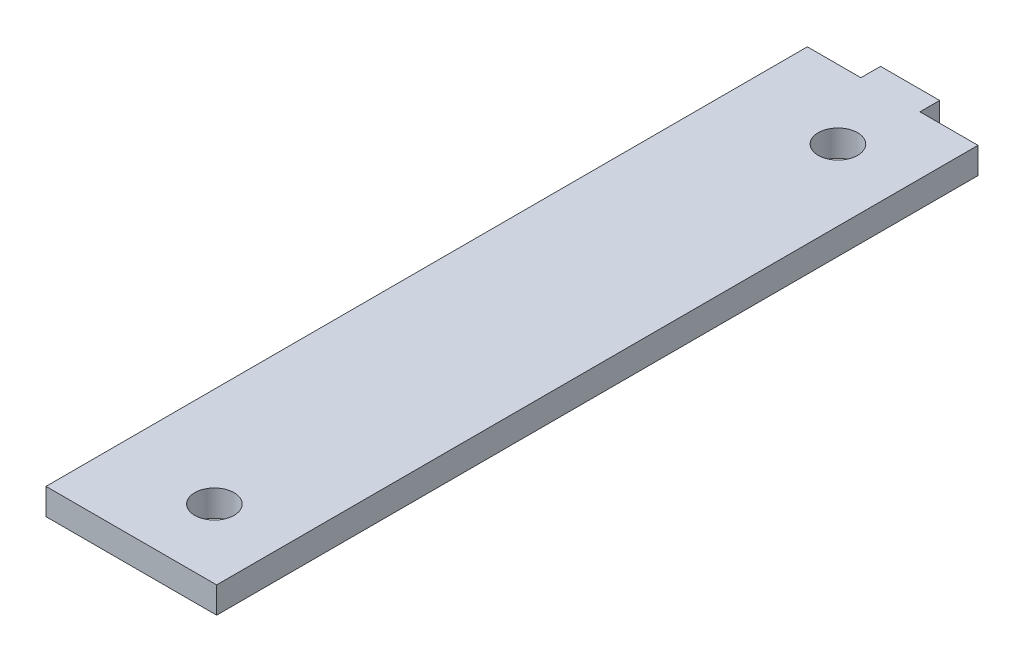
ISO-10303-21;
HEADER;
FILE_DESCRIPTION(('STEP AP214'),'2;1');
FILE_NAME('part.step','',(''),(''),'','','');
FILE_SCHEMA(('AUTOMOTIVE_DESIGN { 1 0 10303 214 1 1 1 1 }'));
ENDSEC;
DATA;
#1=APPLICATION_CONTEXT('core data for automotive mechanical design processes');
#2=APPLICATION_PROTOCOL_DEFINITION('international standard','automotive_design',2000,#1);
#3=PRODUCT_CONTEXT('',#1,'mechanical');
#4=PRODUCT('Part','Part','',(#3));
#5=PRODUCT_RELATED_PRODUCT_CATEGORY('part','',(#4));
#6=PRODUCT_DEFINITION_FORMATION('','',#4);
#7=PRODUCT_DEFINITION_CONTEXT('part definition',#1,'design');
#8=PRODUCT_DEFINITION('design','',#6,#7);
#9=PRODUCT_DEFINITION_SHAPE('','',#8);
#10=(LENGTH_UNIT() NAMED_UNIT(*) SI_UNIT(.MILLI.,.METRE.));
#11=(NAMED_UNIT(*) PLANE_ANGLE_UNIT() SI_UNIT($,.RADIAN.));
#12=(NAMED_UNIT(*) SI_UNIT($,.STERADIAN.) SOLID_ANGLE_UNIT());
#13=UNCERTAINTY_MEASURE_WITH_UNIT(LENGTH_MEASURE(1.E-05),#10,'distance_accuracy_value','');
#14=(GEOMETRIC_REPRESENTATION_CONTEXT(3) GLOBAL_UNCERTAINTY_ASSIGNED_CONTEXT((#13)) GLOBAL_UNIT_ASSIGNED_CONTEXT((#10,
#11,#12)) REPRESENTATION_CONTEXT('',''));
#15=CARTESIAN_POINT('',(0.,0.,0.));
#16=DIRECTION('',(0.,0.,1.));
#17=DIRECTION('',(1.,0.,0.));
#18=AXIS2_PLACEMENT_3D('',#15,#16,#17);
#19=CARTESIAN_POINT('',(70.5,210.,0.));
#20=DIRECTION('',(0.,0.,-1.));
#21=DIRECTION('',(-1.,0.,0.));
#22=AXIS2_PLACEMENT_3D('',#19,#20,#21);
#23=PLANE('',#22);
#24=DIRECTION('',(0.,1.,0.));
#25=VECTOR('',#24,1.);
#26=CARTESIAN_POINT('',(70.5,210.,0.));
#27=LINE('',#26,#25);
#28=CARTESIAN_POINT('',(70.5,206.,0.));
#29=VERTEX_POINT('',#28);
#30=CARTESIAN_POINT('',(70.5,210.,0.));
#31=VERTEX_POINT('',#30);
#32=EDGE_CURVE('E11',#29,#31,#27,.T.);
#33=ORIENTED_EDGE('',*,*,#32,.F.);
#34=DIRECTION('',(1.,0.,0.));
#35=VECTOR('',#34,1.);
#36=CARTESIAN_POINT('',(0.,206.,0.));
#37=LINE('',#36,#35);
#38=CARTESIAN_POINT('',(62.3431457505075,206.,0.));
#39=VERTEX_POINT('',#38);
#40=EDGE_CURVE('E104',#29,#39,#37,.F.);
#41=ORIENTED_EDGE('',*,*,#40,.T.);
#42=DIRECTION('',(0.,1.,0.));
#43=VECTOR('',#42,1.);
#44=CARTESIAN_POINT('',(62.3431457505075,210.,0.));
#45=LINE('',#44,#43);
#46=CARTESIAN_POINT('',(62.3431457505075,210.,0.));
#47=VERTEX_POINT('',#46);
#48=EDGE_CURVE('E47',#39,#47,#45,.T.);
#49=ORIENTED_EDGE('',*,*,#48,.T.);
#50=DIRECTION('',(-1.,0.,0.));
#51=VECTOR('',#50,1.);
#52=CARTESIAN_POINT('',(70.5,210.,0.));
#53=LINE('',#52,#51);
#54=EDGE_CURVE('E146',#31,#47,#53,.T.);
#55=ORIENTED_EDGE('',*,*,#54,.F.);
#56=EDGE_LOOP('',(#33,#41,#49,#55));
#57=FACE_BOUND('',#56,.T.);
#58=ADVANCED_FACE('F37',(#57),#23,.T.);
#59=CARTESIAN_POINT('',(62.3431457505075,210.,0.));
#60=DIRECTION('',(-1.,0.,0.));
#61=DIRECTION('',(0.,0.,1.));
#62=AXIS2_PLACEMENT_3D('',#59,#60,#61);
#63=PLANE('',#62);
#64=ORIENTED_EDGE('',*,*,#48,.F.);
#65=DIRECTION('',(0.,0.,1.));
#66=VECTOR('',#65,1.);
#67=CARTESIAN_POINT('',(62.3431457505075,206.,0.));
#68=LINE('',#67,#66);
#69=CARTESIAN_POINT('',(62.3431457505076,206.,116.));
#70=VERTEX_POINT('',#69);
#71=EDGE_CURVE('E126',#39,#70,#68,.T.);
#72=ORIENTED_EDGE('',*,*,#71,.T.);
#73=DIRECTION('',(0.,1.,0.));
#74=VECTOR('',#73,1.);
#75=CARTESIAN_POINT('',(62.3431457505076,210.,116.));
#76=LINE('',#75,#74);
#77=CARTESIAN_POINT('',(62.3431457505076,210.,116.));
#78=VERTEX_POINT('',#77);
#79=EDGE_CURVE('E139',#70,#78,#76,.T.);
#80=ORIENTED_EDGE('',*,*,#79,.T.);
#81=DIRECTION('',(0.,0.,1.));
#82=VECTOR('',#81,1.);
#83=CARTESIAN_POINT('',(62.3431457505075,210.,0.));
#84=LINE('',#83,#82);
#85=EDGE_CURVE('E155',#47,#78,#84,.T.);
#86=ORIENTED_EDGE('',*,*,#85,.F.);
#87=EDGE_LOOP('',(#64,#72,#80,#86));
#88=FACE_BOUND('',#87,.T.);
#89=ADVANCED_FACE('F158',(#88),#63,.T.);
#90=CARTESIAN_POINT('',(62.3431457505076,210.,116.));
#91=DIRECTION('',(0.,0.,1.));
#92=DIRECTION('',(1.,0.,0.));
#93=AXIS2_PLACEMENT_3D('',#90,#91,#92);
#94=PLANE('',#93);
#95=ORIENTED_EDGE('',*,*,#79,.F.);
#96=DIRECTION('',(1.,0.,0.));
#97=VECTOR('',#96,1.);
#98=CARTESIAN_POINT('',(0.,206.,116.));
#99=LINE('',#98,#97);
#100=CARTESIAN_POINT('',(88.3431457505076,206.,116.));
#101=VERTEX_POINT('',#100);
#102=EDGE_CURVE('E123',#70,#101,#99,.T.);
#103=ORIENTED_EDGE('',*,*,#102,.T.);
#104=DIRECTION('',(0.,1.,0.));
#105=VECTOR('',#104,1.);
#106=CARTESIAN_POINT('',(88.3431457505076,210.,116.));
#107=LINE('',#106,#105);
#108=CARTESIAN_POINT('',(88.3431457505076,210.,116.));
#109=VERTEX_POINT('',#108);
#110=EDGE_CURVE('E136',#101,#109,#107,.T.);
#111=ORIENTED_EDGE('',*,*,#110,.T.);
#112=DIRECTION('',(1.,0.,0.));
#113=VECTOR('',#112,1.);
#114=CARTESIAN_POINT('',(62.3431457505076,210.,116.));
#115=LINE('',#114,#113);
#116=EDGE_CURVE('E159',#78,#109,#115,.T.);
#117=ORIENTED_EDGE('',*,*,#116,.F.);
#118=EDGE_LOOP('',(#95,#103,#111,#117));
#119=FACE_BOUND('',#118,.T.);
#120=ADVANCED_FACE('F195',(#119),#94,.T.);
#121=CARTESIAN_POINT('',(88.3431457505076,210.,116.));
#122=DIRECTION('',(1.,0.,0.));
#123=DIRECTION('',(0.,0.,-1.));
#124=AXIS2_PLACEMENT_3D('',#121,#122,#123);
#125=PLANE('',#124);
#126=ORIENTED_EDGE('',*,*,#110,.F.);
#127=DIRECTION('',(0.,0.,1.));
#128=VECTOR('',#127,1.);
#129=CARTESIAN_POINT('',(88.3431457505076,206.,0.));
#130=LINE('',#129,#128);
#131=CARTESIAN_POINT('',(88.3431457505076,206.,0.));
#132=VERTEX_POINT('',#131);
#133=EDGE_CURVE('E120',#101,#132,#130,.F.);
#134=ORIENTED_EDGE('',*,*,#133,.T.);
#135=DIRECTION('',(0.,1.,0.));
#136=VECTOR('',#135,1.);
#137=CARTESIAN_POINT('',(88.3431457505076,210.,0.));
#138=LINE('',#137,#136);
#139=CARTESIAN_POINT('',(88.3431457505076,210.,0.));
#140=VERTEX_POINT('',#139);
#141=EDGE_CURVE('E133',#132,#140,#138,.T.);
#142=ORIENTED_EDGE('',*,*,#141,.T.);
#143=DIRECTION('',(0.,0.,-1.));
#144=VECTOR('',#143,1.);
#145=CARTESIAN_POINT('',(88.3431457505076,210.,116.));
#146=LINE('',#145,#144);
#147=EDGE_CURVE('E161',#109,#140,#146,.T.);
#148=ORIENTED_EDGE('',*,*,#147,.F.);
#149=EDGE_LOOP('',(#126,#134,#142,#148));
#150=FACE_BOUND('',#149,.T.);
#151=ADVANCED_FACE('F200',(#150),#125,.T.);
#152=CARTESIAN_POINT('',(88.3431457505076,210.,0.));
#153=DIRECTION('',(0.,0.,-1.));
#154=DIRECTION('',(-1.,0.,0.));
#155=AXIS2_PLACEMENT_3D('',#152,#153,#154);
#156=PLANE('',#155);
#157=ORIENTED_EDGE('',*,*,#141,.F.);
#158=DIRECTION('',(1.,0.,0.));
#159=VECTOR('',#158,1.);
#160=CARTESIAN_POINT('',(0.,206.,0.));
#161=LINE('',#160,#159);
#162=CARTESIAN_POINT('',(79.5,206.,0.));
#163=VERTEX_POINT('',#162);
#164=EDGE_CURVE('E117',#132,#163,#161,.F.);
#165=ORIENTED_EDGE('',*,*,#164,.T.);
#166=DIRECTION('',(0.,1.,0.));
#167=VECTOR('',#166,1.);
#168=CARTESIAN_POINT('',(79.5,210.,0.));
#169=LINE('',#168,#167);
#170=CARTESIAN_POINT('',(79.5,210.,0.));
#171=VERTEX_POINT('',#170);
#172=EDGE_CURVE('E131',#163,#171,#169,.T.);
#173=ORIENTED_EDGE('',*,*,#172,.T.);
#174=DIRECTION('',(-1.,0.,0.));
#175=VECTOR('',#174,1.);
#176=CARTESIAN_POINT('',(88.3431457505076,210.,0.));
#177=LINE('',#176,#175);
#178=EDGE_CURVE('E167',#140,#171,#177,.T.);
#179=ORIENTED_EDGE('',*,*,#178,.F.);
#180=EDGE_LOOP('',(#157,#165,#173,#179));
#181=FACE_BOUND('',#180,.T.);
#182=ADVANCED_FACE('F204',(#181),#156,.T.);
#183=CARTESIAN_POINT('',(79.5,210.,0.));
#184=DIRECTION('',(1.,0.,0.));
#185=DIRECTION('',(0.,0.,-1.));
#186=AXIS2_PLACEMENT_3D('',#183,#184,#185);
#187=PLANE('',#186);
#188=ORIENTED_EDGE('',*,*,#172,.F.);
#189=DIRECTION('',(0.,0.,1.));
#190=VECTOR('',#189,1.);
#191=CARTESIAN_POINT('',(79.5,206.,0.));
#192=LINE('',#191,#190);
#193=CARTESIAN_POINT('',(79.5,206.,-3.));
#194=VERTEX_POINT('',#193);
#195=EDGE_CURVE('E114',#163,#194,#192,.F.);
#196=ORIENTED_EDGE('',*,*,#195,.T.);
#197=DIRECTION('',(0.,1.,0.));
#198=VECTOR('',#197,1.);
#199=CARTESIAN_POINT('',(79.5,210.,-3.));
#200=LINE('',#199,#198);
#201=CARTESIAN_POINT('',(79.5,210.,-3.));
#202=VERTEX_POINT('',#201);
#203=EDGE_CURVE('E55',#194,#202,#200,.T.);
#204=ORIENTED_EDGE('',*,*,#203,.T.);
#205=DIRECTION('',(0.,0.,-1.));
#206=VECTOR('',#205,1.);
#207=CARTESIAN_POINT('',(79.5,210.,0.));
#208=LINE('',#207,#206);
#209=EDGE_CURVE('E97',#171,#202,#208,.T.);
#210=ORIENTED_EDGE('',*,*,#209,.F.);
#211=EDGE_LOOP('',(#188,#196,#204,#210));
#212=FACE_BOUND('',#211,.T.);
#213=ADVANCED_FACE('F187',(#212),#187,.T.);
#214=CARTESIAN_POINT('',(79.5,210.,-3.));
#215=DIRECTION('',(0.,0.,-1.));
#216=DIRECTION('',(-1.,0.,0.));
#217=AXIS2_PLACEMENT_3D('',#214,#215,#216);
#218=PLANE('',#217);
#219=ORIENTED_EDGE('',*,*,#203,.F.);
#220=DIRECTION('',(1.,0.,0.));
#221=VECTOR('',#220,1.);
#222=CARTESIAN_POINT('',(0.,206.,-3.));
#223=LINE('',#222,#221);
#224=CARTESIAN_POINT('',(70.5,206.,-3.));
#225=VERTEX_POINT('',#224);
#226=EDGE_CURVE('E102',#194,#225,#223,.F.);
#227=ORIENTED_EDGE('',*,*,#226,.T.);
#228=DIRECTION('',(0.,1.,0.));
#229=VECTOR('',#228,1.);
#230=CARTESIAN_POINT('',(70.5,210.,-3.));
#231=LINE('',#230,#229);
#232=CARTESIAN_POINT('',(70.5,210.,-3.));
#233=VERTEX_POINT('',#232);
#234=EDGE_CURVE('E41',#225,#233,#231,.T.);
#235=ORIENTED_EDGE('',*,*,#234,.T.);
#236=DIRECTION('',(-1.,0.,0.));
#237=VECTOR('',#236,1.);
#238=CARTESIAN_POINT('',(79.5,210.,-3.));
#239=LINE('',#238,#237);
#240=EDGE_CURVE('E222',#202,#233,#239,.T.);
#241=ORIENTED_EDGE('',*,*,#240,.F.);
#242=EDGE_LOOP('',(#219,#227,#235,#241));
#243=FACE_BOUND('',#242,.T.);
#244=ADVANCED_FACE('F106',(#243),#218,.T.);
#245=CARTESIAN_POINT('',(77.5,210.,105.5));
#246=DIRECTION('',(0.,1.,0.));
#247=DIRECTION('',(0.,0.,1.));
#248=AXIS2_PLACEMENT_3D('',#245,#246,#247);
#249=CYLINDRICAL_SURFACE('',#248,3.);
#250=CARTESIAN_POINT('',(77.5,210.,105.5));
#251=DIRECTION('',(0.,1.,0.));
#252=DIRECTION('',(0.,0.,1.));
#253=AXIS2_PLACEMENT_3D('',#250,#251,#252);
#254=CIRCLE('',#253,3.);
#255=CARTESIAN_POINT('',(77.5,210.,108.5));
#256=VERTEX_POINT('',#255);
#257=EDGE_CURVE('E116',#256,#256,#254,.T.);
#258=ORIENTED_EDGE('',*,*,#257,.T.);
#259=EDGE_LOOP('',(#258));
#260=FACE_BOUND('',#259,.T.);
#261=CARTESIAN_POINT('',(77.5,206.,105.5));
#262=DIRECTION('',(0.,1.,0.));
#263=DIRECTION('',(0.,0.,1.));
#264=AXIS2_PLACEMENT_3D('',#261,#262,#263);
#265=CIRCLE('',#264,3.);
#266=CARTESIAN_POINT('',(77.5,206.,108.5));
#267=VERTEX_POINT('',#266);
#268=EDGE_CURVE('E110',#267,#267,#265,.T.);
#269=ORIENTED_EDGE('',*,*,#268,.F.);
#270=EDGE_LOOP('',(#269));
#271=FACE_BOUND('',#270,.T.);
#272=ADVANCED_FACE('F176',(#260,#271),#249,.F.);
#273=CARTESIAN_POINT('',(77.5,210.,10.5));
#274=DIRECTION('',(0.,1.,0.));
#275=DIRECTION('',(0.,0.,1.));
#276=AXIS2_PLACEMENT_3D('',#273,#274,#275);
#277=CYLINDRICAL_SURFACE('',#276,3.);
#278=CARTESIAN_POINT('',(77.5,210.,10.5));
#279=DIRECTION('',(0.,1.,0.));
#280=DIRECTION('',(0.,0.,1.));
#281=AXIS2_PLACEMENT_3D('',#278,#279,#280);
#282=CIRCLE('',#281,3.);
#283=CARTESIAN_POINT('',(77.5,210.,13.5));
#284=VERTEX_POINT('',#283);
#285=EDGE_CURVE('E223',#284,#284,#282,.T.);
#286=ORIENTED_EDGE('',*,*,#285,.T.);
#287=EDGE_LOOP('',(#286));
#288=FACE_BOUND('',#287,.T.);
#289=CARTESIAN_POINT('',(77.5,206.,10.5));
#290=DIRECTION('',(0.,1.,0.));
#291=DIRECTION('',(0.,0.,1.));
#292=AXIS2_PLACEMENT_3D('',#289,#290,#291);
#293=CIRCLE('',#292,3.);
#294=CARTESIAN_POINT('',(77.5,206.,13.5));
#295=VERTEX_POINT('',#294);
#296=EDGE_CURVE('E107',#295,#295,#293,.T.);
#297=ORIENTED_EDGE('',*,*,#296,.F.);
#298=EDGE_LOOP('',(#297));
#299=FACE_BOUND('',#298,.T.);
#300=ADVANCED_FACE('F178',(#288,#299),#277,.F.);
#301=CARTESIAN_POINT('',(70.5,210.,-3.));
#302=DIRECTION('',(-1.,0.,0.));
#303=DIRECTION('',(0.,0.,1.));
#304=AXIS2_PLACEMENT_3D('',#301,#302,#303);
#305=PLANE('',#304);
#306=DIRECTION('',(0.,0.,1.));
#307=VECTOR('',#306,1.);
#308=CARTESIAN_POINT('',(70.5,206.,0.));
#309=LINE('',#308,#307);
#310=EDGE_CURVE('E91',#225,#29,#309,.T.);
#311=ORIENTED_EDGE('',*,*,#310,.T.);
#312=ORIENTED_EDGE('',*,*,#32,.T.);
#313=DIRECTION('',(0.,0.,1.));
#314=VECTOR('',#313,1.);
#315=CARTESIAN_POINT('',(70.5,210.,-3.));
#316=LINE('',#315,#314);
#317=EDGE_CURVE('E93',#233,#31,#316,.T.);
#318=ORIENTED_EDGE('',*,*,#317,.F.);
#319=ORIENTED_EDGE('',*,*,#234,.F.);
#320=EDGE_LOOP('',(#311,#312,#318,#319));
#321=FACE_BOUND('',#320,.T.);
#322=ADVANCED_FACE('F39',(#321),#305,.T.);
#323=CARTESIAN_POINT('',(0.,210.,0.));
#324=DIRECTION('',(0.,1.,0.));
#325=DIRECTION('',(0.,0.,1.));
#326=AXIS2_PLACEMENT_3D('',#323,#324,#325);
#327=PLANE('',#326);
#328=ORIENTED_EDGE('',*,*,#257,.F.);
#329=EDGE_LOOP('',(#328));
#330=FACE_BOUND('',#329,.T.);
#331=ORIENTED_EDGE('',*,*,#285,.F.);
#332=EDGE_LOOP('',(#331));
#333=FACE_BOUND('',#332,.T.);
#334=ORIENTED_EDGE('',*,*,#240,.T.);
#335=ORIENTED_EDGE('',*,*,#317,.T.);
#336=ORIENTED_EDGE('',*,*,#54,.T.);
#337=ORIENTED_EDGE('',*,*,#85,.T.);
#338=ORIENTED_EDGE('',*,*,#116,.T.);
#339=ORIENTED_EDGE('',*,*,#147,.T.);
#340=ORIENTED_EDGE('',*,*,#178,.T.);
#341=ORIENTED_EDGE('',*,*,#209,.T.);
#342=EDGE_LOOP('',(#334,#335,#336,#337,#338,#339,#340,#341));
#343=FACE_BOUND('',#342,.T.);
#344=ADVANCED_FACE('F153',(#330,#333,#343),#327,.T.);
#345=CARTESIAN_POINT('',(0.,206.,0.));
#346=DIRECTION('',(0.,1.,0.));
#347=DIRECTION('',(0.,0.,1.));
#348=AXIS2_PLACEMENT_3D('',#345,#346,#347);
#349=PLANE('',#348);
#350=ORIENTED_EDGE('',*,*,#268,.T.);
#351=EDGE_LOOP('',(#350));
#352=FACE_BOUND('',#351,.T.);
#353=ORIENTED_EDGE('',*,*,#296,.T.);
#354=EDGE_LOOP('',(#353));
#355=FACE_BOUND('',#354,.T.);
#356=ORIENTED_EDGE('',*,*,#226,.F.);
#357=ORIENTED_EDGE('',*,*,#195,.F.);
#358=ORIENTED_EDGE('',*,*,#164,.F.);
#359=ORIENTED_EDGE('',*,*,#133,.F.);
#360=ORIENTED_EDGE('',*,*,#102,.F.);
#361=ORIENTED_EDGE('',*,*,#71,.F.);
#362=ORIENTED_EDGE('',*,*,#40,.F.);
#363=ORIENTED_EDGE('',*,*,#310,.F.);
#364=EDGE_LOOP('',(#356,#357,#358,#359,#360,#361,#362,#363));
#365=FACE_BOUND('',#364,.T.);
#366=ADVANCED_FACE('F100',(#352,#355,#365),#349,.F.);
#367=CLOSED_SHELL('',(#58,#89,#120,#151,#182,#213,#244,#272,#300,#322,#344,#366));
#368=MANIFOLD_SOLID_BREP('B2',#367);
#369=ADVANCED_BREP_SHAPE_REPRESENTATION('',(#18,#368),#14);
#370=SHAPE_DEFINITION_REPRESENTATION(#9,#369);
ENDSEC;
END-ISO-10303-21;
